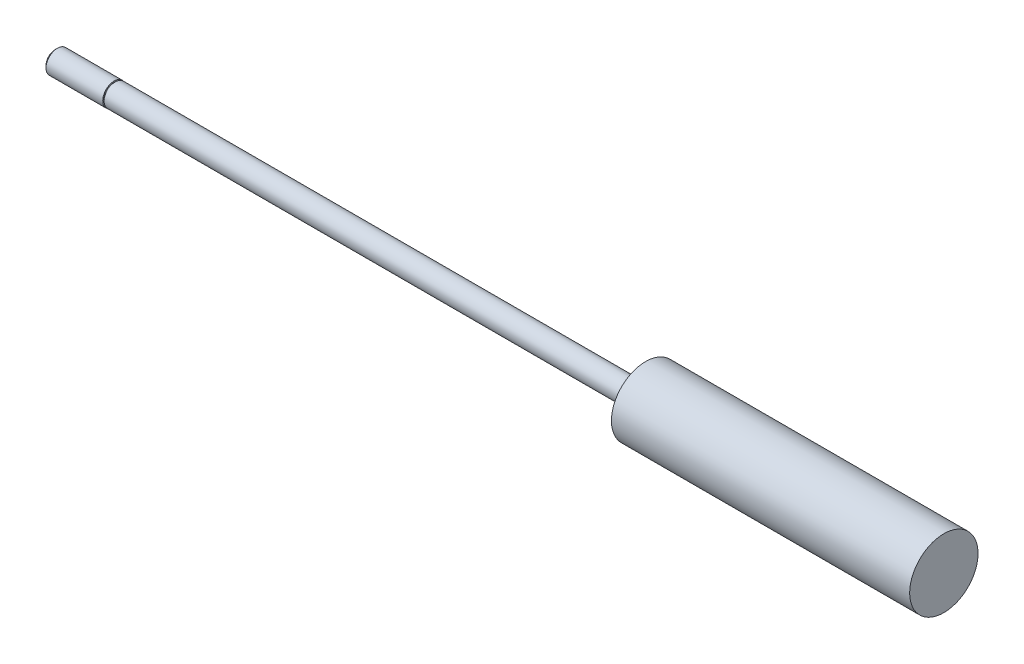
ISO-10303-21;
HEADER;
FILE_DESCRIPTION(('STEP AP214'),'2;1');
FILE_NAME('part.step','',(''),(''),'','','');
FILE_SCHEMA(('AUTOMOTIVE_DESIGN { 1 0 10303 214 1 1 1 1 }'));
ENDSEC;
DATA;
#1=APPLICATION_CONTEXT('core data for automotive mechanical design processes');
#2=APPLICATION_PROTOCOL_DEFINITION('international standard','automotive_design',2000,#1);
#3=PRODUCT_CONTEXT('',#1,'mechanical');
#4=PRODUCT('Part','Part','',(#3));
#5=PRODUCT_RELATED_PRODUCT_CATEGORY('part','',(#4));
#6=PRODUCT_DEFINITION_FORMATION('','',#4);
#7=PRODUCT_DEFINITION_CONTEXT('part definition',#1,'design');
#8=PRODUCT_DEFINITION('design','',#6,#7);
#9=PRODUCT_DEFINITION_SHAPE('','',#8);
#10=(LENGTH_UNIT() NAMED_UNIT(*) SI_UNIT(.MILLI.,.METRE.));
#11=(NAMED_UNIT(*) PLANE_ANGLE_UNIT() SI_UNIT($,.RADIAN.));
#12=(NAMED_UNIT(*) SI_UNIT($,.STERADIAN.) SOLID_ANGLE_UNIT());
#13=UNCERTAINTY_MEASURE_WITH_UNIT(LENGTH_MEASURE(1.E-05),#10,'distance_accuracy_value','');
#14=(GEOMETRIC_REPRESENTATION_CONTEXT(3) GLOBAL_UNCERTAINTY_ASSIGNED_CONTEXT((#13)) GLOBAL_UNIT_ASSIGNED_CONTEXT((#10,
#11,#12)) REPRESENTATION_CONTEXT('',''));
#15=CARTESIAN_POINT('',(0.,0.,0.));
#16=DIRECTION('',(0.,0.,1.));
#17=DIRECTION('',(1.,0.,0.));
#18=AXIS2_PLACEMENT_3D('',#15,#16,#17);
#19=CARTESIAN_POINT('',(174.8536,0.,0.));
#20=DIRECTION('',(-1.,0.,0.));
#21=DIRECTION('',(0.,0.,1.));
#22=AXIS2_PLACEMENT_3D('',#19,#20,#21);
#23=CYLINDRICAL_SURFACE('',#22,2.3749);
#24=CARTESIAN_POINT('',(0.,0.,0.));
#25=DIRECTION('',(-1.,0.,0.));
#26=DIRECTION('',(0.,0.,1.));
#27=AXIS2_PLACEMENT_3D('',#24,#25,#26);
#28=CIRCLE('',#27,2.3749);
#29=CARTESIAN_POINT('',(0.,0.,2.3749));
#30=VERTEX_POINT('',#29);
#31=EDGE_CURVE('E56',#30,#30,#28,.T.);
#32=ORIENTED_EDGE('',*,*,#31,.F.);
#33=EDGE_LOOP('',(#32));
#34=FACE_BOUND('',#33,.T.);
#35=CARTESIAN_POINT('',(111.9124,0.,0.));
#36=DIRECTION('',(-1.,0.,0.));
#37=DIRECTION('',(0.,0.,1.));
#38=AXIS2_PLACEMENT_3D('',#35,#36,#37);
#39=CIRCLE('',#38,2.3749);
#40=CARTESIAN_POINT('',(111.9124,0.,2.3749));
#41=VERTEX_POINT('',#40);
#42=EDGE_CURVE('E10',#41,#41,#39,.T.);
#43=ORIENTED_EDGE('',*,*,#42,.T.);
#44=EDGE_LOOP('',(#43));
#45=FACE_BOUND('',#44,.T.);
#46=ADVANCED_FACE('F34',(#34,#45),#23,.T.);
#47=CARTESIAN_POINT('',(111.9124,2.3749,0.));
#48=DIRECTION('',(1.,0.,0.));
#49=DIRECTION('',(0.,0.,-1.));
#50=AXIS2_PLACEMENT_3D('',#47,#48,#49);
#51=PLANE('',#50);
#52=ORIENTED_EDGE('',*,*,#42,.F.);
#53=EDGE_LOOP('',(#52));
#54=FACE_BOUND('',#53,.T.);
#55=CARTESIAN_POINT('',(111.9124,0.,0.));
#56=DIRECTION('',(-1.,0.,0.));
#57=DIRECTION('',(0.,0.,1.));
#58=AXIS2_PLACEMENT_3D('',#55,#56,#57);
#59=CIRCLE('',#58,7.21995);
#60=CARTESIAN_POINT('',(111.9124,0.,7.21995));
#61=VERTEX_POINT('',#60);
#62=EDGE_CURVE('E41',#61,#61,#59,.T.);
#63=ORIENTED_EDGE('',*,*,#62,.T.);
#64=EDGE_LOOP('',(#63));
#65=FACE_BOUND('',#64,.T.);
#66=ADVANCED_FACE('F77',(#54,#65),#51,.F.);
#67=CARTESIAN_POINT('',(174.8536,0.,0.));
#68=DIRECTION('',(-1.,0.,0.));
#69=DIRECTION('',(0.,0.,1.));
#70=AXIS2_PLACEMENT_3D('',#67,#68,#69);
#71=CYLINDRICAL_SURFACE('',#70,7.21995);
#72=ORIENTED_EDGE('',*,*,#62,.F.);
#73=EDGE_LOOP('',(#72));
#74=FACE_BOUND('',#73,.T.);
#75=CARTESIAN_POINT('',(174.8536,0.,0.));
#76=DIRECTION('',(-1.,0.,0.));
#77=DIRECTION('',(0.,0.,1.));
#78=AXIS2_PLACEMENT_3D('',#75,#76,#77);
#79=CIRCLE('',#78,7.21995);
#80=CARTESIAN_POINT('',(174.8536,0.,7.21995));
#81=VERTEX_POINT('',#80);
#82=EDGE_CURVE('E45',#81,#81,#79,.T.);
#83=ORIENTED_EDGE('',*,*,#82,.T.);
#84=EDGE_LOOP('',(#83));
#85=FACE_BOUND('',#84,.T.);
#86=ADVANCED_FACE('F81',(#74,#85),#71,.T.);
#87=CARTESIAN_POINT('',(174.8536,7.21995,0.));
#88=DIRECTION('',(-1.,0.,0.));
#89=DIRECTION('',(0.,0.,1.));
#90=AXIS2_PLACEMENT_3D('',#87,#88,#89);
#91=PLANE('',#90);
#92=ORIENTED_EDGE('',*,*,#82,.F.);
#93=EDGE_LOOP('',(#92));
#94=FACE_BOUND('',#93,.T.);
#95=ADVANCED_FACE('F86',(#94),#91,.F.);
#96=CARTESIAN_POINT('',(-0.254,2.667,0.));
#97=DIRECTION('',(1.,0.,0.));
#98=DIRECTION('',(0.,0.,-1.));
#99=AXIS2_PLACEMENT_3D('',#96,#97,#98);
#100=PLANE('',#99);
#101=CARTESIAN_POINT('',(-0.254,0.,0.));
#102=DIRECTION('',(-1.,0.,0.));
#103=DIRECTION('',(0.,0.,1.));
#104=AXIS2_PLACEMENT_3D('',#101,#102,#103);
#105=CIRCLE('',#104,2.159);
#106=CARTESIAN_POINT('',(-0.254,0.,2.159));
#107=VERTEX_POINT('',#106);
#108=EDGE_CURVE('E59',#107,#107,#105,.T.);
#109=ORIENTED_EDGE('',*,*,#108,.T.);
#110=EDGE_LOOP('',(#109));
#111=FACE_BOUND('',#110,.T.);
#112=CARTESIAN_POINT('',(-0.254,0.,0.));
#113=DIRECTION('',(1.,0.,0.));
#114=DIRECTION('',(0.,0.,-1.));
#115=AXIS2_PLACEMENT_3D('',#112,#113,#114);
#116=CIRCLE('',#115,2.413);
#117=CARTESIAN_POINT('',(-0.254,0.,-2.413));
#118=VERTEX_POINT('',#117);
#119=EDGE_CURVE('E37',#118,#118,#116,.T.);
#120=ORIENTED_EDGE('',*,*,#119,.T.);
#121=EDGE_LOOP('',(#120));
#122=FACE_BOUND('',#121,.T.);
#123=ADVANCED_FACE('F72',(#111,#122),#100,.T.);
#124=CARTESIAN_POINT('',(0.,2.159,0.));
#125=DIRECTION('',(-1.,0.,0.));
#126=DIRECTION('',(0.,0.,1.));
#127=AXIS2_PLACEMENT_3D('',#124,#125,#126);
#128=PLANE('',#127);
#129=CARTESIAN_POINT('',(0.,0.,0.));
#130=DIRECTION('',(-1.,0.,0.));
#131=DIRECTION('',(0.,0.,1.));
#132=AXIS2_PLACEMENT_3D('',#129,#130,#131);
#133=CIRCLE('',#132,2.159);
#134=CARTESIAN_POINT('',(0.,0.,2.159));
#135=VERTEX_POINT('',#134);
#136=EDGE_CURVE('E62',#135,#135,#133,.T.);
#137=ORIENTED_EDGE('',*,*,#136,.F.);
#138=EDGE_LOOP('',(#137));
#139=FACE_BOUND('',#138,.T.);
#140=ORIENTED_EDGE('',*,*,#31,.T.);
#141=EDGE_LOOP('',(#140));
#142=FACE_BOUND('',#141,.T.);
#143=ADVANCED_FACE('F69',(#139,#142),#128,.T.);
#144=CARTESIAN_POINT('',(0.,0.,0.));
#145=DIRECTION('',(-1.,0.,0.));
#146=DIRECTION('',(0.,0.,1.));
#147=AXIS2_PLACEMENT_3D('',#144,#145,#146);
#148=CYLINDRICAL_SURFACE('',#147,2.159);
#149=ORIENTED_EDGE('',*,*,#136,.T.);
#150=EDGE_LOOP('',(#149));
#151=FACE_BOUND('',#150,.T.);
#152=ORIENTED_EDGE('',*,*,#108,.F.);
#153=EDGE_LOOP('',(#152));
#154=FACE_BOUND('',#153,.T.);
#155=ADVANCED_FACE('F66',(#151,#154),#148,.T.);
#156=CARTESIAN_POINT('',(-12.7,0.,0.));
#157=DIRECTION('',(1.,0.,0.));
#158=DIRECTION('',(0.,0.,-1.));
#159=AXIS2_PLACEMENT_3D('',#156,#157,#158);
#160=PLANE('',#159);
#161=CARTESIAN_POINT('',(-12.7,0.,0.));
#162=DIRECTION('',(-1.,0.,0.));
#163=DIRECTION('',(0.,0.,1.));
#164=AXIS2_PLACEMENT_3D('',#161,#162,#163);
#165=CIRCLE('',#164,1.94056);
#166=CARTESIAN_POINT('',(-12.7,0.,1.94056));
#167=VERTEX_POINT('',#166);
#168=EDGE_CURVE('E50',#167,#167,#165,.T.);
#169=ORIENTED_EDGE('',*,*,#168,.T.);
#170=EDGE_LOOP('',(#169));
#171=FACE_BOUND('',#170,.T.);
#172=ADVANCED_FACE('F94',(#171),#160,.F.);
#173=CARTESIAN_POINT('',(-12.22756,0.,0.));
#174=DIRECTION('',(1.,0.,0.));
#175=DIRECTION('',(0.,0.,-1.));
#176=AXIS2_PLACEMENT_3D('',#173,#174,#175);
#177=CONICAL_SURFACE('',#176,2.413,0.785398163397449);
#178=ORIENTED_EDGE('',*,*,#168,.F.);
#179=EDGE_LOOP('',(#178));
#180=FACE_BOUND('',#179,.T.);
#181=CARTESIAN_POINT('',(-12.22756,0.,0.));
#182=DIRECTION('',(-1.,0.,0.));
#183=DIRECTION('',(0.,0.,1.));
#184=AXIS2_PLACEMENT_3D('',#181,#182,#183);
#185=CIRCLE('',#184,2.413);
#186=CARTESIAN_POINT('',(-12.22756,0.,2.413));
#187=VERTEX_POINT('',#186);
#188=EDGE_CURVE('E53',#187,#187,#185,.T.);
#189=ORIENTED_EDGE('',*,*,#188,.T.);
#190=EDGE_LOOP('',(#189));
#191=FACE_BOUND('',#190,.T.);
#192=ADVANCED_FACE('F97',(#180,#191),#177,.T.);
#193=CARTESIAN_POINT('',(0.,0.,0.));
#194=DIRECTION('',(-1.,0.,0.));
#195=DIRECTION('',(0.,0.,1.));
#196=AXIS2_PLACEMENT_3D('',#193,#194,#195);
#197=CYLINDRICAL_SURFACE('',#196,2.413);
#198=ORIENTED_EDGE('',*,*,#188,.F.);
#199=EDGE_LOOP('',(#198));
#200=FACE_BOUND('',#199,.T.);
#201=ORIENTED_EDGE('',*,*,#119,.F.);
#202=EDGE_LOOP('',(#201));
#203=FACE_BOUND('',#202,.T.);
#204=ADVANCED_FACE('F101',(#200,#203),#197,.T.);
#205=CLOSED_SHELL('',(#46,#66,#86,#95,#123,#143,#155,#172,#192,#204));
#206=MANIFOLD_SOLID_BREP('B2',#205);
#207=ADVANCED_BREP_SHAPE_REPRESENTATION('',(#18,#206),#14);
#208=SHAPE_DEFINITION_REPRESENTATION(#9,#207);
ENDSEC;
END-ISO-10303-21;
